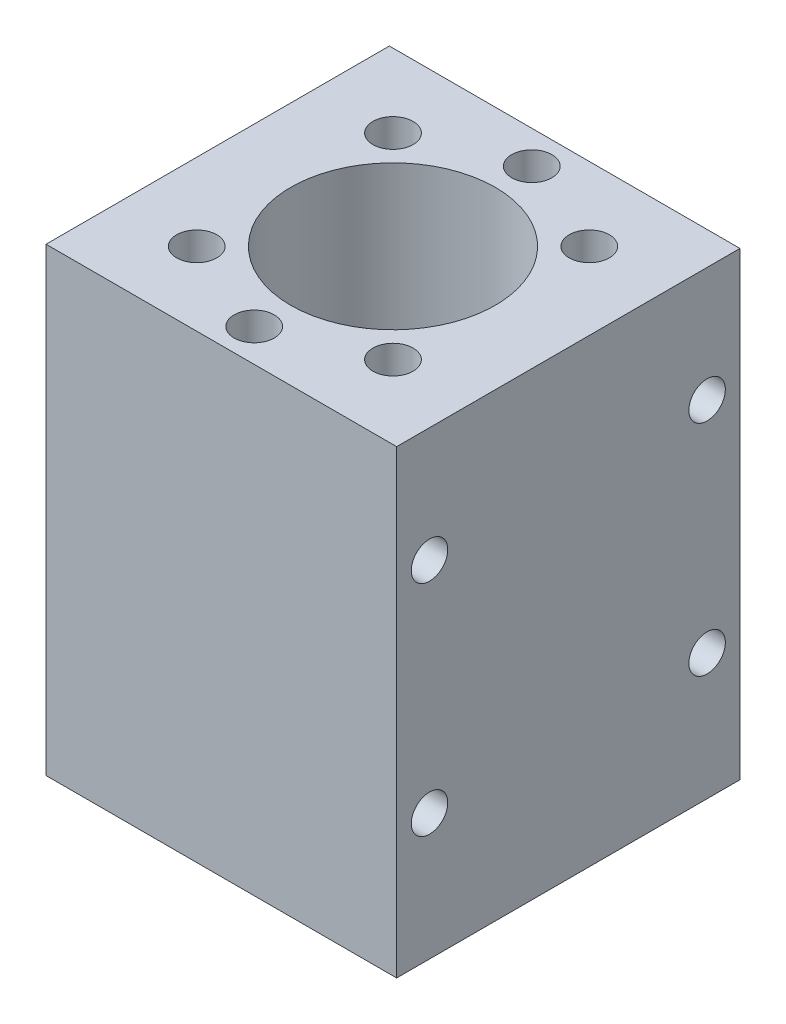
ISO-10303-21;
HEADER;
FILE_DESCRIPTION(('STEP AP214'),'2;1');
FILE_NAME('part.step','',(''),(''),'','','');
FILE_SCHEMA(('AUTOMOTIVE_DESIGN { 1 0 10303 214 1 1 1 1 }'));
ENDSEC;
DATA;
#1=APPLICATION_CONTEXT('core data for automotive mechanical design processes');
#2=APPLICATION_PROTOCOL_DEFINITION('international standard','automotive_design',2000,#1);
#3=PRODUCT_CONTEXT('',#1,'mechanical');
#4=PRODUCT('Part','Part','',(#3));
#5=PRODUCT_RELATED_PRODUCT_CATEGORY('part','',(#4));
#6=PRODUCT_DEFINITION_FORMATION('','',#4);
#7=PRODUCT_DEFINITION_CONTEXT('part definition',#1,'design');
#8=PRODUCT_DEFINITION('design','',#6,#7);
#9=PRODUCT_DEFINITION_SHAPE('','',#8);
#10=(LENGTH_UNIT() NAMED_UNIT(*) SI_UNIT(.MILLI.,.METRE.));
#11=(NAMED_UNIT(*) PLANE_ANGLE_UNIT() SI_UNIT($,.RADIAN.));
#12=(NAMED_UNIT(*) SI_UNIT($,.STERADIAN.) SOLID_ANGLE_UNIT());
#13=UNCERTAINTY_MEASURE_WITH_UNIT(LENGTH_MEASURE(1.E-05),#10,'distance_accuracy_value','');
#14=(GEOMETRIC_REPRESENTATION_CONTEXT(3) GLOBAL_UNCERTAINTY_ASSIGNED_CONTEXT((#13)) GLOBAL_UNIT_ASSIGNED_CONTEXT((#10,
#11,#12)) REPRESENTATION_CONTEXT('',''));
#15=CARTESIAN_POINT('',(0.,0.,0.));
#16=DIRECTION('',(0.,0.,1.));
#17=DIRECTION('',(1.,0.,0.));
#18=AXIS2_PLACEMENT_3D('',#15,#16,#17);
#19=CARTESIAN_POINT('',(0.,63.,0.));
#20=DIRECTION('',(0.,-1.,0.));
#21=DIRECTION('',(0.,0.,-1.));
#22=AXIS2_PLACEMENT_3D('',#19,#20,#21);
#23=PLANE('',#22);
#24=CARTESIAN_POINT('',(-13.4350288424246,63.,-13.4350288426159));
#25=DIRECTION('',(0.,1.,0.));
#26=DIRECTION('',(0.,0.,1.));
#27=AXIS2_PLACEMENT_3D('',#24,#25,#26);
#28=CIRCLE('',#27,2.74999999998649);
#29=CARTESIAN_POINT('',(-13.4350288424246,63.,-10.6850288426294));
#30=VERTEX_POINT('',#29);
#31=EDGE_CURVE('E174',#30,#30,#28,.T.);
#32=ORIENTED_EDGE('',*,*,#31,.F.);
#33=EDGE_LOOP('',(#32));
#34=FACE_BOUND('',#33,.T.);
#35=CARTESIAN_POINT('',(1.0369483049999E-10,63.,-19.0000000000646));
#36=DIRECTION('',(0.,1.,0.));
#37=DIRECTION('',(0.,0.,1.));
#38=AXIS2_PLACEMENT_3D('',#35,#36,#37);
#39=CIRCLE('',#38,2.75);
#40=CARTESIAN_POINT('',(1.0369483049999E-10,63.,-16.2500000000646));
#41=VERTEX_POINT('',#40);
#42=EDGE_CURVE('E168',#41,#41,#39,.T.);
#43=ORIENTED_EDGE('',*,*,#42,.F.);
#44=EDGE_LOOP('',(#43));
#45=FACE_BOUND('',#44,.T.);
#46=CARTESIAN_POINT('',(13.4350288426527,63.,-13.4350288426135));
#47=DIRECTION('',(0.,1.,0.));
#48=DIRECTION('',(0.,0.,1.));
#49=AXIS2_PLACEMENT_3D('',#46,#47,#48);
#50=CIRCLE('',#49,2.7499999999981);
#51=CARTESIAN_POINT('',(13.4350288426527,63.,-10.6850288426154));
#52=VERTEX_POINT('',#51);
#53=EDGE_CURVE('E162',#52,#52,#50,.T.);
#54=ORIENTED_EDGE('',*,*,#53,.F.);
#55=EDGE_LOOP('',(#54));
#56=FACE_BOUND('',#55,.T.);
#57=CARTESIAN_POINT('',(-13.4350288424347,63.,13.4350288424767));
#58=DIRECTION('',(0.,1.,0.));
#59=DIRECTION('',(0.,0.,1.));
#60=AXIS2_PLACEMENT_3D('',#57,#58,#59);
#61=CIRCLE('',#60,2.75000000000403);
#62=CARTESIAN_POINT('',(-13.4350288424347,63.,16.1850288424808));
#63=VERTEX_POINT('',#62);
#64=EDGE_CURVE('E156',#63,#63,#61,.T.);
#65=ORIENTED_EDGE('',*,*,#64,.F.);
#66=EDGE_LOOP('',(#65));
#67=FACE_BOUND('',#66,.T.);
#68=CARTESIAN_POINT('',(1.11174412295756E-10,63.,18.9999999999354));
#69=DIRECTION('',(0.,1.,0.));
#70=DIRECTION('',(0.,0.,1.));
#71=AXIS2_PLACEMENT_3D('',#68,#69,#70);
#72=CIRCLE('',#71,2.75000000000728);
#73=CARTESIAN_POINT('',(1.11174412295756E-10,63.,21.7499999999427));
#74=VERTEX_POINT('',#73);
#75=EDGE_CURVE('E150',#74,#74,#72,.T.);
#76=ORIENTED_EDGE('',*,*,#75,.F.);
#77=EDGE_LOOP('',(#76));
#78=FACE_BOUND('',#77,.T.);
#79=CARTESIAN_POINT('',(13.435028842658,63.,13.4350288424791));
#80=DIRECTION('',(0.,1.,0.));
#81=DIRECTION('',(0.,0.,1.));
#82=AXIS2_PLACEMENT_3D('',#79,#80,#81);
#83=CIRCLE('',#82,2.75000000000538);
#84=CARTESIAN_POINT('',(13.435028842658,63.,16.1850288424845));
#85=VERTEX_POINT('',#84);
#86=EDGE_CURVE('E144',#85,#85,#83,.T.);
#87=ORIENTED_EDGE('',*,*,#86,.F.);
#88=EDGE_LOOP('',(#87));
#89=FACE_BOUND('',#88,.T.);
#90=DIRECTION('',(0.,0.,-1.));
#91=VECTOR('',#90,1.);
#92=CARTESIAN_POINT('',(24.,63.,23.5));
#93=LINE('',#92,#91);
#94=CARTESIAN_POINT('',(24.,63.,23.5));
#95=VERTEX_POINT('',#94);
#96=CARTESIAN_POINT('',(24.,63.,-23.5));
#97=VERTEX_POINT('',#96);
#98=EDGE_CURVE('E87',#95,#97,#93,.T.);
#99=ORIENTED_EDGE('',*,*,#98,.T.);
#100=DIRECTION('',(-1.,0.,0.));
#101=VECTOR('',#100,1.);
#102=CARTESIAN_POINT('',(-24.,63.,-23.5));
#103=LINE('',#102,#101);
#104=CARTESIAN_POINT('',(-24.,63.,-23.5));
#105=VERTEX_POINT('',#104);
#106=EDGE_CURVE('E82',#97,#105,#103,.T.);
#107=ORIENTED_EDGE('',*,*,#106,.T.);
#108=DIRECTION('',(0.,0.,1.));
#109=VECTOR('',#108,1.);
#110=CARTESIAN_POINT('',(-24.,63.,23.5));
#111=LINE('',#110,#109);
#112=CARTESIAN_POINT('',(-24.,63.,23.5));
#113=VERTEX_POINT('',#112);
#114=EDGE_CURVE('E85',#105,#113,#111,.T.);
#115=ORIENTED_EDGE('',*,*,#114,.T.);
#116=DIRECTION('',(1.,0.,0.));
#117=VECTOR('',#116,1.);
#118=CARTESIAN_POINT('',(-24.,63.,23.5));
#119=LINE('',#118,#117);
#120=EDGE_CURVE('E52',#113,#95,#119,.T.);
#121=ORIENTED_EDGE('',*,*,#120,.T.);
#122=EDGE_LOOP('',(#99,#107,#115,#121));
#123=FACE_BOUND('',#122,.T.);
#124=CARTESIAN_POINT('',(0.,63.,0.));
#125=DIRECTION('',(0.,1.,0.));
#126=DIRECTION('',(0.,0.,1.));
#127=AXIS2_PLACEMENT_3D('',#124,#125,#126);
#128=CIRCLE('',#127,14.);
#129=CARTESIAN_POINT('',(0.,63.,14.));
#130=VERTEX_POINT('',#129);
#131=EDGE_CURVE('E102',#130,#130,#128,.T.);
#132=ORIENTED_EDGE('',*,*,#131,.F.);
#133=EDGE_LOOP('',(#132));
#134=FACE_BOUND('',#133,.T.);
#135=ADVANCED_FACE('F35',(#34,#45,#56,#67,#78,#89,#123,#134),#23,.F.);
#136=CARTESIAN_POINT('',(0.,0.,0.));
#137=DIRECTION('',(0.,-1.,0.));
#138=DIRECTION('',(0.,0.,-1.));
#139=AXIS2_PLACEMENT_3D('',#136,#137,#138);
#140=PLANE('',#139);
#141=DIRECTION('',(0.,0.,-1.));
#142=VECTOR('',#141,1.);
#143=CARTESIAN_POINT('',(24.,0.,23.5));
#144=LINE('',#143,#142);
#145=CARTESIAN_POINT('',(24.,0.,23.5));
#146=VERTEX_POINT('',#145);
#147=CARTESIAN_POINT('',(24.,0.,-23.5));
#148=VERTEX_POINT('',#147);
#149=EDGE_CURVE('E99',#146,#148,#144,.T.);
#150=ORIENTED_EDGE('',*,*,#149,.F.);
#151=DIRECTION('',(1.,0.,0.));
#152=VECTOR('',#151,1.);
#153=CARTESIAN_POINT('',(-24.,0.,23.5));
#154=LINE('',#153,#152);
#155=CARTESIAN_POINT('',(-24.,0.,23.5));
#156=VERTEX_POINT('',#155);
#157=EDGE_CURVE('E75',#156,#146,#154,.T.);
#158=ORIENTED_EDGE('',*,*,#157,.F.);
#159=DIRECTION('',(0.,0.,1.));
#160=VECTOR('',#159,1.);
#161=CARTESIAN_POINT('',(-24.,0.,23.5));
#162=LINE('',#161,#160);
#163=CARTESIAN_POINT('',(-24.,0.,-23.5));
#164=VERTEX_POINT('',#163);
#165=EDGE_CURVE('E69',#164,#156,#162,.T.);
#166=ORIENTED_EDGE('',*,*,#165,.F.);
#167=DIRECTION('',(-1.,0.,0.));
#168=VECTOR('',#167,1.);
#169=CARTESIAN_POINT('',(-24.,0.,-23.5));
#170=LINE('',#169,#168);
#171=EDGE_CURVE('E91',#148,#164,#170,.T.);
#172=ORIENTED_EDGE('',*,*,#171,.F.);
#173=EDGE_LOOP('',(#150,#158,#166,#172));
#174=FACE_BOUND('',#173,.T.);
#175=CARTESIAN_POINT('',(0.,0.,0.));
#176=DIRECTION('',(0.,1.,0.));
#177=DIRECTION('',(0.,0.,1.));
#178=AXIS2_PLACEMENT_3D('',#175,#176,#177);
#179=CIRCLE('',#178,14.);
#180=CARTESIAN_POINT('',(0.,0.,14.));
#181=VERTEX_POINT('',#180);
#182=EDGE_CURVE('E114',#181,#181,#179,.T.);
#183=ORIENTED_EDGE('',*,*,#182,.T.);
#184=EDGE_LOOP('',(#183));
#185=FACE_BOUND('',#184,.T.);
#186=ADVANCED_FACE('F110',(#174,#185),#140,.T.);
#187=CARTESIAN_POINT('',(24.,63.,23.5));
#188=DIRECTION('',(-1.,0.,0.));
#189=DIRECTION('',(0.,0.,1.));
#190=AXIS2_PLACEMENT_3D('',#187,#188,#189);
#191=PLANE('',#190);
#192=CARTESIAN_POINT('',(24.,17.3000000000111,18.9999999940562));
#193=DIRECTION('',(-1.,0.,0.));
#194=DIRECTION('',(0.,0.,1.));
#195=AXIS2_PLACEMENT_3D('',#192,#193,#194);
#196=CIRCLE('',#195,2.49999999999999);
#197=CARTESIAN_POINT('',(24.,17.3000000000111,21.4999999940562));
#198=VERTEX_POINT('',#197);
#199=EDGE_CURVE('E135',#198,#198,#196,.T.);
#200=ORIENTED_EDGE('',*,*,#199,.T.);
#201=EDGE_LOOP('',(#200));
#202=FACE_BOUND('',#201,.T.);
#203=CARTESIAN_POINT('',(24.,47.3000000000111,18.9999999940562));
#204=DIRECTION('',(-1.,0.,0.));
#205=DIRECTION('',(0.,0.,1.));
#206=AXIS2_PLACEMENT_3D('',#203,#204,#205);
#207=CIRCLE('',#206,2.49999999999998);
#208=CARTESIAN_POINT('',(24.,47.3000000000111,21.4999999940562));
#209=VERTEX_POINT('',#208);
#210=EDGE_CURVE('E129',#209,#209,#207,.T.);
#211=ORIENTED_EDGE('',*,*,#210,.T.);
#212=EDGE_LOOP('',(#211));
#213=FACE_BOUND('',#212,.T.);
#214=CARTESIAN_POINT('',(24.,17.3000000000111,-19.0000000059438));
#215=DIRECTION('',(-1.,0.,0.));
#216=DIRECTION('',(0.,0.,1.));
#217=AXIS2_PLACEMENT_3D('',#214,#215,#216);
#218=CIRCLE('',#217,2.49999999999999);
#219=CARTESIAN_POINT('',(24.,17.3000000000111,-16.5000000059438));
#220=VERTEX_POINT('',#219);
#221=EDGE_CURVE('E123',#220,#220,#218,.T.);
#222=ORIENTED_EDGE('',*,*,#221,.T.);
#223=EDGE_LOOP('',(#222));
#224=FACE_BOUND('',#223,.T.);
#225=CARTESIAN_POINT('',(24.,47.3000000000111,-19.0000000059438));
#226=DIRECTION('',(-1.,0.,0.));
#227=DIRECTION('',(0.,0.,1.));
#228=AXIS2_PLACEMENT_3D('',#225,#226,#227);
#229=CIRCLE('',#228,2.49999999999999);
#230=CARTESIAN_POINT('',(24.,47.3000000000111,-16.5000000059438));
#231=VERTEX_POINT('',#230);
#232=EDGE_CURVE('E117',#231,#231,#229,.T.);
#233=ORIENTED_EDGE('',*,*,#232,.T.);
#234=EDGE_LOOP('',(#233));
#235=FACE_BOUND('',#234,.T.);
#236=ORIENTED_EDGE('',*,*,#149,.T.);
#237=DIRECTION('',(0.,-1.,0.));
#238=VECTOR('',#237,1.);
#239=CARTESIAN_POINT('',(24.,63.,-23.5));
#240=LINE('',#239,#238);
#241=EDGE_CURVE('E11',#97,#148,#240,.T.);
#242=ORIENTED_EDGE('',*,*,#241,.F.);
#243=ORIENTED_EDGE('',*,*,#98,.F.);
#244=DIRECTION('',(0.,-1.,0.));
#245=VECTOR('',#244,1.);
#246=CARTESIAN_POINT('',(24.,63.,23.5));
#247=LINE('',#246,#245);
#248=EDGE_CURVE('E95',#95,#146,#247,.T.);
#249=ORIENTED_EDGE('',*,*,#248,.T.);
#250=EDGE_LOOP('',(#236,#242,#243,#249));
#251=FACE_BOUND('',#250,.T.);
#252=ADVANCED_FACE('F37',(#202,#213,#224,#235,#251),#191,.F.);
#253=CARTESIAN_POINT('',(-24.,63.,-23.5));
#254=DIRECTION('',(0.,0.,1.));
#255=DIRECTION('',(1.,0.,0.));
#256=AXIS2_PLACEMENT_3D('',#253,#254,#255);
#257=PLANE('',#256);
#258=ORIENTED_EDGE('',*,*,#171,.T.);
#259=DIRECTION('',(0.,-1.,0.));
#260=VECTOR('',#259,1.);
#261=CARTESIAN_POINT('',(-24.,63.,-23.5));
#262=LINE('',#261,#260);
#263=EDGE_CURVE('E44',#105,#164,#262,.T.);
#264=ORIENTED_EDGE('',*,*,#263,.F.);
#265=ORIENTED_EDGE('',*,*,#106,.F.);
#266=ORIENTED_EDGE('',*,*,#241,.T.);
#267=EDGE_LOOP('',(#258,#264,#265,#266));
#268=FACE_BOUND('',#267,.T.);
#269=ADVANCED_FACE('F90',(#268),#257,.F.);
#270=CARTESIAN_POINT('',(-24.,63.,23.5));
#271=DIRECTION('',(1.,0.,0.));
#272=DIRECTION('',(0.,0.,-1.));
#273=AXIS2_PLACEMENT_3D('',#270,#271,#272);
#274=PLANE('',#273);
#275=CARTESIAN_POINT('',(-24.,17.3000000000111,18.9999999940562));
#276=DIRECTION('',(-1.,0.,0.));
#277=DIRECTION('',(0.,0.,1.));
#278=AXIS2_PLACEMENT_3D('',#275,#276,#277);
#279=CIRCLE('',#278,2.49999999999999);
#280=CARTESIAN_POINT('',(-24.,17.3000000000111,21.4999999940562));
#281=VERTEX_POINT('',#280);
#282=EDGE_CURVE('E138',#281,#281,#279,.T.);
#283=ORIENTED_EDGE('',*,*,#282,.F.);
#284=EDGE_LOOP('',(#283));
#285=FACE_BOUND('',#284,.T.);
#286=CARTESIAN_POINT('',(-24.,47.3000000000111,18.9999999940562));
#287=DIRECTION('',(-1.,0.,0.));
#288=DIRECTION('',(0.,0.,1.));
#289=AXIS2_PLACEMENT_3D('',#286,#287,#288);
#290=CIRCLE('',#289,2.49999999999998);
#291=CARTESIAN_POINT('',(-24.,47.3000000000111,21.4999999940562));
#292=VERTEX_POINT('',#291);
#293=EDGE_CURVE('E132',#292,#292,#290,.T.);
#294=ORIENTED_EDGE('',*,*,#293,.F.);
#295=EDGE_LOOP('',(#294));
#296=FACE_BOUND('',#295,.T.);
#297=CARTESIAN_POINT('',(-24.,17.3000000000111,-19.0000000059438));
#298=DIRECTION('',(-1.,0.,0.));
#299=DIRECTION('',(0.,0.,1.));
#300=AXIS2_PLACEMENT_3D('',#297,#298,#299);
#301=CIRCLE('',#300,2.49999999999999);
#302=CARTESIAN_POINT('',(-24.,17.3000000000111,-16.5000000059438));
#303=VERTEX_POINT('',#302);
#304=EDGE_CURVE('E126',#303,#303,#301,.T.);
#305=ORIENTED_EDGE('',*,*,#304,.F.);
#306=EDGE_LOOP('',(#305));
#307=FACE_BOUND('',#306,.T.);
#308=CARTESIAN_POINT('',(-24.,47.3000000000111,-19.0000000059438));
#309=DIRECTION('',(-1.,0.,0.));
#310=DIRECTION('',(0.,0.,1.));
#311=AXIS2_PLACEMENT_3D('',#308,#309,#310);
#312=CIRCLE('',#311,2.49999999999999);
#313=CARTESIAN_POINT('',(-24.,47.3000000000111,-16.5000000059438));
#314=VERTEX_POINT('',#313);
#315=EDGE_CURVE('E120',#314,#314,#312,.T.);
#316=ORIENTED_EDGE('',*,*,#315,.F.);
#317=EDGE_LOOP('',(#316));
#318=FACE_BOUND('',#317,.T.);
#319=ORIENTED_EDGE('',*,*,#165,.T.);
#320=DIRECTION('',(0.,-1.,0.));
#321=VECTOR('',#320,1.);
#322=CARTESIAN_POINT('',(-24.,63.,23.5));
#323=LINE('',#322,#321);
#324=EDGE_CURVE('E92',#113,#156,#323,.T.);
#325=ORIENTED_EDGE('',*,*,#324,.F.);
#326=ORIENTED_EDGE('',*,*,#114,.F.);
#327=ORIENTED_EDGE('',*,*,#263,.T.);
#328=EDGE_LOOP('',(#319,#325,#326,#327));
#329=FACE_BOUND('',#328,.T.);
#330=ADVANCED_FACE('F93',(#285,#296,#307,#318,#329),#274,.F.);
#331=CARTESIAN_POINT('',(-24.,63.,23.5));
#332=DIRECTION('',(0.,0.,-1.));
#333=DIRECTION('',(-1.,0.,0.));
#334=AXIS2_PLACEMENT_3D('',#331,#332,#333);
#335=PLANE('',#334);
#336=ORIENTED_EDGE('',*,*,#157,.T.);
#337=ORIENTED_EDGE('',*,*,#248,.F.);
#338=ORIENTED_EDGE('',*,*,#120,.F.);
#339=ORIENTED_EDGE('',*,*,#324,.T.);
#340=EDGE_LOOP('',(#336,#337,#338,#339));
#341=FACE_BOUND('',#340,.T.);
#342=ADVANCED_FACE('F107',(#341),#335,.F.);
#343=CARTESIAN_POINT('',(0.,63.,0.));
#344=DIRECTION('',(0.,-1.,0.));
#345=DIRECTION('',(0.,0.,-1.));
#346=AXIS2_PLACEMENT_3D('',#343,#344,#345);
#347=CYLINDRICAL_SURFACE('',#346,14.);
#348=ORIENTED_EDGE('',*,*,#131,.T.);
#349=EDGE_LOOP('',(#348));
#350=FACE_BOUND('',#349,.T.);
#351=ORIENTED_EDGE('',*,*,#182,.F.);
#352=EDGE_LOOP('',(#351));
#353=FACE_BOUND('',#352,.T.);
#354=ADVANCED_FACE('F231',(#350,#353),#347,.F.);
#355=CARTESIAN_POINT('',(24.,47.3000000000111,-19.0000000059438));
#356=DIRECTION('',(-1.,0.,0.));
#357=DIRECTION('',(0.,0.,1.));
#358=AXIS2_PLACEMENT_3D('',#355,#356,#357);
#359=CYLINDRICAL_SURFACE('',#358,2.49999999999999);
#360=ORIENTED_EDGE('',*,*,#232,.F.);
#361=EDGE_LOOP('',(#360));
#362=FACE_BOUND('',#361,.T.);
#363=ORIENTED_EDGE('',*,*,#315,.T.);
#364=EDGE_LOOP('',(#363));
#365=FACE_BOUND('',#364,.T.);
#366=ADVANCED_FACE('F227',(#362,#365),#359,.F.);
#367=CARTESIAN_POINT('',(24.,17.3000000000111,-19.0000000059438));
#368=DIRECTION('',(-1.,0.,0.));
#369=DIRECTION('',(0.,0.,1.));
#370=AXIS2_PLACEMENT_3D('',#367,#368,#369);
#371=CYLINDRICAL_SURFACE('',#370,2.49999999999999);
#372=ORIENTED_EDGE('',*,*,#221,.F.);
#373=EDGE_LOOP('',(#372));
#374=FACE_BOUND('',#373,.T.);
#375=ORIENTED_EDGE('',*,*,#304,.T.);
#376=EDGE_LOOP('',(#375));
#377=FACE_BOUND('',#376,.T.);
#378=ADVANCED_FACE('F223',(#374,#377),#371,.F.);
#379=CARTESIAN_POINT('',(24.,47.3000000000111,18.9999999940562));
#380=DIRECTION('',(-1.,0.,0.));
#381=DIRECTION('',(0.,0.,1.));
#382=AXIS2_PLACEMENT_3D('',#379,#380,#381);
#383=CYLINDRICAL_SURFACE('',#382,2.49999999999998);
#384=ORIENTED_EDGE('',*,*,#210,.F.);
#385=EDGE_LOOP('',(#384));
#386=FACE_BOUND('',#385,.T.);
#387=ORIENTED_EDGE('',*,*,#293,.T.);
#388=EDGE_LOOP('',(#387));
#389=FACE_BOUND('',#388,.T.);
#390=ADVANCED_FACE('F215',(#386,#389),#383,.F.);
#391=CARTESIAN_POINT('',(24.,17.3000000000111,18.9999999940562));
#392=DIRECTION('',(-1.,0.,0.));
#393=DIRECTION('',(0.,0.,1.));
#394=AXIS2_PLACEMENT_3D('',#391,#392,#393);
#395=CYLINDRICAL_SURFACE('',#394,2.49999999999999);
#396=ORIENTED_EDGE('',*,*,#199,.F.);
#397=EDGE_LOOP('',(#396));
#398=FACE_BOUND('',#397,.T.);
#399=ORIENTED_EDGE('',*,*,#282,.T.);
#400=EDGE_LOOP('',(#399));
#401=FACE_BOUND('',#400,.T.);
#402=ADVANCED_FACE('F205',(#398,#401),#395,.F.);
#403=CARTESIAN_POINT('',(13.435028842658,53.,13.4350288424791));
#404=DIRECTION('',(0.,1.,0.));
#405=DIRECTION('',(0.,0.,1.));
#406=AXIS2_PLACEMENT_3D('',#403,#404,#405);
#407=CYLINDRICAL_SURFACE('',#406,2.75000000000538);
#408=CARTESIAN_POINT('',(13.435028842658,53.,13.4350288424791));
#409=DIRECTION('',(0.,1.,0.));
#410=DIRECTION('',(0.,0.,1.));
#411=AXIS2_PLACEMENT_3D('',#408,#409,#410);
#412=CIRCLE('',#411,2.75000000000538);
#413=CARTESIAN_POINT('',(13.435028842658,53.,16.1850288424845));
#414=VERTEX_POINT('',#413);
#415=EDGE_CURVE('E141',#414,#414,#412,.T.);
#416=ORIENTED_EDGE('',*,*,#415,.F.);
#417=EDGE_LOOP('',(#416));
#418=FACE_BOUND('',#417,.T.);
#419=ORIENTED_EDGE('',*,*,#86,.T.);
#420=EDGE_LOOP('',(#419));
#421=FACE_BOUND('',#420,.T.);
#422=ADVANCED_FACE('F202',(#418,#421),#407,.F.);
#423=CARTESIAN_POINT('',(13.435028842658,53.,13.4350288424791));
#424=DIRECTION('',(0.,1.,0.));
#425=DIRECTION('',(0.,0.,1.));
#426=AXIS2_PLACEMENT_3D('',#423,#424,#425);
#427=PLANE('',#426);
#428=ORIENTED_EDGE('',*,*,#415,.T.);
#429=EDGE_LOOP('',(#428));
#430=FACE_BOUND('',#429,.T.);
#431=ADVANCED_FACE('F204',(#430),#427,.T.);
#432=CARTESIAN_POINT('',(1.11174412295756E-10,53.,18.9999999999354));
#433=DIRECTION('',(0.,1.,0.));
#434=DIRECTION('',(0.,0.,1.));
#435=AXIS2_PLACEMENT_3D('',#432,#433,#434);
#436=CYLINDRICAL_SURFACE('',#435,2.75000000000728);
#437=CARTESIAN_POINT('',(1.11174412295756E-10,53.,18.9999999999354));
#438=DIRECTION('',(0.,1.,0.));
#439=DIRECTION('',(0.,0.,1.));
#440=AXIS2_PLACEMENT_3D('',#437,#438,#439);
#441=CIRCLE('',#440,2.75000000000728);
#442=CARTESIAN_POINT('',(1.11174412295756E-10,53.,21.7499999999427));
#443=VERTEX_POINT('',#442);
#444=EDGE_CURVE('E147',#443,#443,#441,.T.);
#445=ORIENTED_EDGE('',*,*,#444,.F.);
#446=EDGE_LOOP('',(#445));
#447=FACE_BOUND('',#446,.T.);
#448=ORIENTED_EDGE('',*,*,#75,.T.);
#449=EDGE_LOOP('',(#448));
#450=FACE_BOUND('',#449,.T.);
#451=ADVANCED_FACE('F212',(#447,#450),#436,.F.);
#452=CARTESIAN_POINT('',(1.11174412295756E-10,53.,18.9999999999354));
#453=DIRECTION('',(0.,1.,0.));
#454=DIRECTION('',(0.,0.,1.));
#455=AXIS2_PLACEMENT_3D('',#452,#453,#454);
#456=PLANE('',#455);
#457=ORIENTED_EDGE('',*,*,#444,.T.);
#458=EDGE_LOOP('',(#457));
#459=FACE_BOUND('',#458,.T.);
#460=ADVANCED_FACE('F300',(#459),#456,.T.);
#461=CARTESIAN_POINT('',(-13.4350288424347,53.,13.4350288424767));
#462=DIRECTION('',(0.,1.,0.));
#463=DIRECTION('',(0.,0.,1.));
#464=AXIS2_PLACEMENT_3D('',#461,#462,#463);
#465=CYLINDRICAL_SURFACE('',#464,2.75000000000403);
#466=CARTESIAN_POINT('',(-13.4350288424347,53.,13.4350288424767));
#467=DIRECTION('',(0.,1.,0.));
#468=DIRECTION('',(0.,0.,1.));
#469=AXIS2_PLACEMENT_3D('',#466,#467,#468);
#470=CIRCLE('',#469,2.75000000000403);
#471=CARTESIAN_POINT('',(-13.4350288424347,53.,16.1850288424808));
#472=VERTEX_POINT('',#471);
#473=EDGE_CURVE('E153',#472,#472,#470,.T.);
#474=ORIENTED_EDGE('',*,*,#473,.F.);
#475=EDGE_LOOP('',(#474));
#476=FACE_BOUND('',#475,.T.);
#477=ORIENTED_EDGE('',*,*,#64,.T.);
#478=EDGE_LOOP('',(#477));
#479=FACE_BOUND('',#478,.T.);
#480=ADVANCED_FACE('F309',(#476,#479),#465,.F.);
#481=CARTESIAN_POINT('',(-13.4350288424347,53.,13.4350288424767));
#482=DIRECTION('',(0.,1.,0.));
#483=DIRECTION('',(0.,0.,1.));
#484=AXIS2_PLACEMENT_3D('',#481,#482,#483);
#485=PLANE('',#484);
#486=ORIENTED_EDGE('',*,*,#473,.T.);
#487=EDGE_LOOP('',(#486));
#488=FACE_BOUND('',#487,.T.);
#489=ADVANCED_FACE('F319',(#488),#485,.T.);
#490=CARTESIAN_POINT('',(13.4350288426527,53.,-13.4350288426135));
#491=DIRECTION('',(0.,1.,0.));
#492=DIRECTION('',(0.,0.,1.));
#493=AXIS2_PLACEMENT_3D('',#490,#491,#492);
#494=CYLINDRICAL_SURFACE('',#493,2.7499999999981);
#495=CARTESIAN_POINT('',(13.4350288426527,53.,-13.4350288426135));
#496=DIRECTION('',(0.,1.,0.));
#497=DIRECTION('',(0.,0.,1.));
#498=AXIS2_PLACEMENT_3D('',#495,#496,#497);
#499=CIRCLE('',#498,2.7499999999981);
#500=CARTESIAN_POINT('',(13.4350288426527,53.,-10.6850288426154));
#501=VERTEX_POINT('',#500);
#502=EDGE_CURVE('E159',#501,#501,#499,.T.);
#503=ORIENTED_EDGE('',*,*,#502,.F.);
#504=EDGE_LOOP('',(#503));
#505=FACE_BOUND('',#504,.T.);
#506=ORIENTED_EDGE('',*,*,#53,.T.);
#507=EDGE_LOOP('',(#506));
#508=FACE_BOUND('',#507,.T.);
#509=ADVANCED_FACE('F329',(#505,#508),#494,.F.);
#510=CARTESIAN_POINT('',(13.4350288426527,53.,-13.4350288426135));
#511=DIRECTION('',(0.,1.,0.));
#512=DIRECTION('',(0.,0.,1.));
#513=AXIS2_PLACEMENT_3D('',#510,#511,#512);
#514=PLANE('',#513);
#515=ORIENTED_EDGE('',*,*,#502,.T.);
#516=EDGE_LOOP('',(#515));
#517=FACE_BOUND('',#516,.T.);
#518=ADVANCED_FACE('F339',(#517),#514,.T.);
#519=CARTESIAN_POINT('',(1.0369483049999E-10,53.,-19.0000000000646));
#520=DIRECTION('',(0.,1.,0.));
#521=DIRECTION('',(0.,0.,1.));
#522=AXIS2_PLACEMENT_3D('',#519,#520,#521);
#523=CYLINDRICAL_SURFACE('',#522,2.75);
#524=CARTESIAN_POINT('',(1.0369483049999E-10,53.,-19.0000000000646));
#525=DIRECTION('',(0.,1.,0.));
#526=DIRECTION('',(0.,0.,1.));
#527=AXIS2_PLACEMENT_3D('',#524,#525,#526);
#528=CIRCLE('',#527,2.75);
#529=CARTESIAN_POINT('',(1.0369483049999E-10,53.,-16.2500000000646));
#530=VERTEX_POINT('',#529);
#531=EDGE_CURVE('E165',#530,#530,#528,.T.);
#532=ORIENTED_EDGE('',*,*,#531,.F.);
#533=EDGE_LOOP('',(#532));
#534=FACE_BOUND('',#533,.T.);
#535=ORIENTED_EDGE('',*,*,#42,.T.);
#536=EDGE_LOOP('',(#535));
#537=FACE_BOUND('',#536,.T.);
#538=ADVANCED_FACE('F349',(#534,#537),#523,.F.);
#539=CARTESIAN_POINT('',(1.0369483049999E-10,53.,-19.0000000000646));
#540=DIRECTION('',(0.,1.,0.));
#541=DIRECTION('',(0.,0.,1.));
#542=AXIS2_PLACEMENT_3D('',#539,#540,#541);
#543=PLANE('',#542);
#544=ORIENTED_EDGE('',*,*,#531,.T.);
#545=EDGE_LOOP('',(#544));
#546=FACE_BOUND('',#545,.T.);
#547=ADVANCED_FACE('F185',(#546),#543,.T.);
#548=CARTESIAN_POINT('',(-13.4350288424246,53.,-13.4350288426159));
#549=DIRECTION('',(0.,1.,0.));
#550=DIRECTION('',(0.,0.,1.));
#551=AXIS2_PLACEMENT_3D('',#548,#549,#550);
#552=CYLINDRICAL_SURFACE('',#551,2.74999999998649);
#553=CARTESIAN_POINT('',(-13.4350288424246,53.,-13.4350288426159));
#554=DIRECTION('',(0.,1.,0.));
#555=DIRECTION('',(0.,0.,1.));
#556=AXIS2_PLACEMENT_3D('',#553,#554,#555);
#557=CIRCLE('',#556,2.74999999998649);
#558=CARTESIAN_POINT('',(-13.4350288424246,53.,-10.6850288426294));
#559=VERTEX_POINT('',#558);
#560=EDGE_CURVE('E171',#559,#559,#557,.T.);
#561=ORIENTED_EDGE('',*,*,#560,.F.);
#562=EDGE_LOOP('',(#561));
#563=FACE_BOUND('',#562,.T.);
#564=ORIENTED_EDGE('',*,*,#31,.T.);
#565=EDGE_LOOP('',(#564));
#566=FACE_BOUND('',#565,.T.);
#567=ADVANCED_FACE('F182',(#563,#566),#552,.F.);
#568=CARTESIAN_POINT('',(-13.4350288424246,53.,-13.4350288426159));
#569=DIRECTION('',(0.,1.,0.));
#570=DIRECTION('',(0.,0.,1.));
#571=AXIS2_PLACEMENT_3D('',#568,#569,#570);
#572=PLANE('',#571);
#573=ORIENTED_EDGE('',*,*,#560,.T.);
#574=EDGE_LOOP('',(#573));
#575=FACE_BOUND('',#574,.T.);
#576=ADVANCED_FACE('F180',(#575),#572,.T.);
#577=CLOSED_SHELL('',(#135,#186,#252,#269,#330,#342,#354,#366,#378,#390,#402,#422,#431,#451,
#460,#480,#489,#509,#518,#538,#547,#567,#576));
#578=MANIFOLD_SOLID_BREP('B2',#577);
#579=ADVANCED_BREP_SHAPE_REPRESENTATION('',(#18,#578),#14);
#580=SHAPE_DEFINITION_REPRESENTATION(#9,#579);
ENDSEC;
END-ISO-10303-21;
